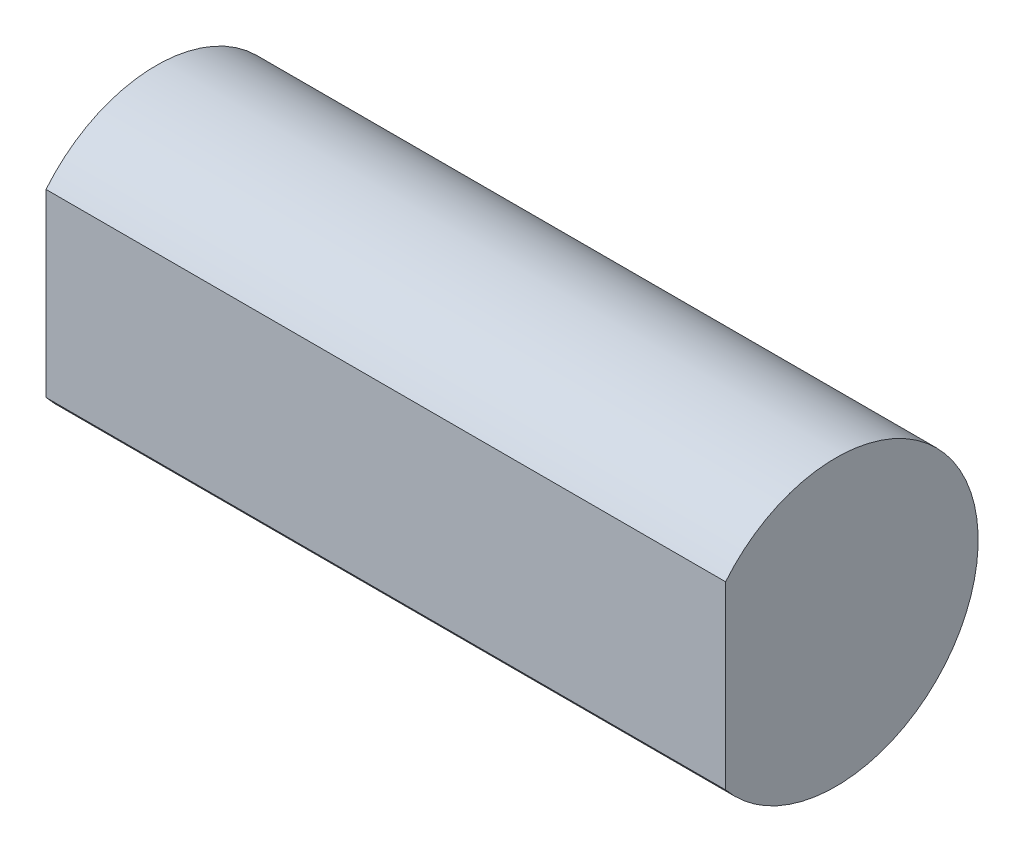
ISO-10303-21;
HEADER;
FILE_DESCRIPTION(('STEP AP214'),'2;1');
FILE_NAME('part.step','',(''),(''),'','','');
FILE_SCHEMA(('AUTOMOTIVE_DESIGN { 1 0 10303 214 1 1 1 1 }'));
ENDSEC;
DATA;
#1=APPLICATION_CONTEXT('core data for automotive mechanical design processes');
#2=APPLICATION_PROTOCOL_DEFINITION('international standard','automotive_design',2000,#1);
#3=PRODUCT_CONTEXT('',#1,'mechanical');
#4=PRODUCT('Part','Part','',(#3));
#5=PRODUCT_RELATED_PRODUCT_CATEGORY('part','',(#4));
#6=PRODUCT_DEFINITION_FORMATION('','',#4);
#7=PRODUCT_DEFINITION_CONTEXT('part definition',#1,'design');
#8=PRODUCT_DEFINITION('design','',#6,#7);
#9=PRODUCT_DEFINITION_SHAPE('','',#8);
#10=(LENGTH_UNIT() NAMED_UNIT(*) SI_UNIT(.MILLI.,.METRE.));
#11=(NAMED_UNIT(*) PLANE_ANGLE_UNIT() SI_UNIT($,.RADIAN.));
#12=(NAMED_UNIT(*) SI_UNIT($,.STERADIAN.) SOLID_ANGLE_UNIT());
#13=UNCERTAINTY_MEASURE_WITH_UNIT(LENGTH_MEASURE(1.E-05),#10,'distance_accuracy_value','');
#14=(GEOMETRIC_REPRESENTATION_CONTEXT(3) GLOBAL_UNCERTAINTY_ASSIGNED_CONTEXT((#13)) GLOBAL_UNIT_ASSIGNED_CONTEXT((#10,
#11,#12)) REPRESENTATION_CONTEXT('',''));
#15=CARTESIAN_POINT('',(0.,0.,0.));
#16=DIRECTION('',(0.,0.,1.));
#17=DIRECTION('',(1.,0.,0.));
#18=AXIS2_PLACEMENT_3D('',#15,#16,#17);
#19=CARTESIAN_POINT('',(18.5,0.,3.));
#20=DIRECTION('',(0.,0.,-1.));
#21=DIRECTION('',(-1.,0.,0.));
#22=AXIS2_PLACEMENT_3D('',#19,#20,#21);
#23=PLANE('',#22);
#24=DIRECTION('',(0.,-1.,0.));
#25=VECTOR('',#24,1.);
#26=CARTESIAN_POINT('',(0.,0.,3.));
#27=LINE('',#26,#25);
#28=CARTESIAN_POINT('',(0.,2.45267710879357,3.));
#29=VERTEX_POINT('',#28);
#30=CARTESIAN_POINT('',(0.,-2.45267710879357,3.));
#31=VERTEX_POINT('',#30);
#32=EDGE_CURVE('E80',#29,#31,#27,.T.);
#33=ORIENTED_EDGE('',*,*,#32,.T.);
#34=DIRECTION('',(-1.,0.,0.));
#35=VECTOR('',#34,1.);
#36=CARTESIAN_POINT('',(18.5,-2.45267710879357,3.));
#37=LINE('',#36,#35);
#38=CARTESIAN_POINT('',(18.5,-2.45267710879357,3.));
#39=VERTEX_POINT('',#38);
#40=EDGE_CURVE('E11',#39,#31,#37,.T.);
#41=ORIENTED_EDGE('',*,*,#40,.F.);
#42=DIRECTION('',(0.,-1.,0.));
#43=VECTOR('',#42,1.);
#44=CARTESIAN_POINT('',(18.5,0.,3.));
#45=LINE('',#44,#43);
#46=CARTESIAN_POINT('',(18.5,2.45267710879357,3.));
#47=VERTEX_POINT('',#46);
#48=EDGE_CURVE('E79',#47,#39,#45,.T.);
#49=ORIENTED_EDGE('',*,*,#48,.F.);
#50=DIRECTION('',(-1.,0.,0.));
#51=VECTOR('',#50,1.);
#52=CARTESIAN_POINT('',(18.5,2.45267710879357,3.));
#53=LINE('',#52,#51);
#54=EDGE_CURVE('E56',#47,#29,#53,.T.);
#55=ORIENTED_EDGE('',*,*,#54,.T.);
#56=EDGE_LOOP('',(#33,#41,#49,#55));
#57=FACE_BOUND('',#56,.T.);
#58=ADVANCED_FACE('F47',(#57),#23,.F.);
#59=CARTESIAN_POINT('',(18.5,0.,0.));
#60=DIRECTION('',(-1.,0.,0.));
#61=DIRECTION('',(0.,0.,1.));
#62=AXIS2_PLACEMENT_3D('',#59,#60,#61);
#63=CYLINDRICAL_SURFACE('',#62,3.875);
#64=CARTESIAN_POINT('',(0.,0.,0.));
#65=DIRECTION('',(1.,0.,0.));
#66=DIRECTION('',(0.,0.,-1.));
#67=AXIS2_PLACEMENT_3D('',#64,#65,#66);
#68=CIRCLE('',#67,3.875);
#69=EDGE_CURVE('E71',#31,#29,#68,.T.);
#70=ORIENTED_EDGE('',*,*,#69,.T.);
#71=ORIENTED_EDGE('',*,*,#54,.F.);
#72=CARTESIAN_POINT('',(18.5,0.,0.));
#73=DIRECTION('',(1.,0.,0.));
#74=DIRECTION('',(0.,0.,-1.));
#75=AXIS2_PLACEMENT_3D('',#72,#73,#74);
#76=CIRCLE('',#75,3.875);
#77=EDGE_CURVE('E63',#39,#47,#76,.T.);
#78=ORIENTED_EDGE('',*,*,#77,.F.);
#79=ORIENTED_EDGE('',*,*,#40,.T.);
#80=EDGE_LOOP('',(#70,#71,#78,#79));
#81=FACE_BOUND('',#80,.T.);
#82=ADVANCED_FACE('F74',(#81),#63,.T.);
#83=CARTESIAN_POINT('',(18.5,0.,0.));
#84=DIRECTION('',(1.,0.,0.));
#85=DIRECTION('',(0.,0.,-1.));
#86=AXIS2_PLACEMENT_3D('',#83,#84,#85);
#87=PLANE('',#86);
#88=ORIENTED_EDGE('',*,*,#48,.T.);
#89=ORIENTED_EDGE('',*,*,#77,.T.);
#90=EDGE_LOOP('',(#88,#89));
#91=FACE_BOUND('',#90,.T.);
#92=ADVANCED_FACE('F91',(#91),#87,.T.);
#93=CARTESIAN_POINT('',(0.,0.,0.));
#94=DIRECTION('',(1.,0.,0.));
#95=DIRECTION('',(0.,0.,-1.));
#96=AXIS2_PLACEMENT_3D('',#93,#94,#95);
#97=PLANE('',#96);
#98=ORIENTED_EDGE('',*,*,#32,.F.);
#99=ORIENTED_EDGE('',*,*,#69,.F.);
#100=EDGE_LOOP('',(#98,#99));
#101=FACE_BOUND('',#100,.T.);
#102=ADVANCED_FACE('F84',(#101),#97,.F.);
#103=CLOSED_SHELL('',(#58,#82,#92,#102));
#104=MANIFOLD_SOLID_BREP('B2',#103);
#105=ADVANCED_BREP_SHAPE_REPRESENTATION('',(#18,#104),#14);
#106=SHAPE_DEFINITION_REPRESENTATION(#9,#105);
ENDSEC;
END-ISO-10303-21;
